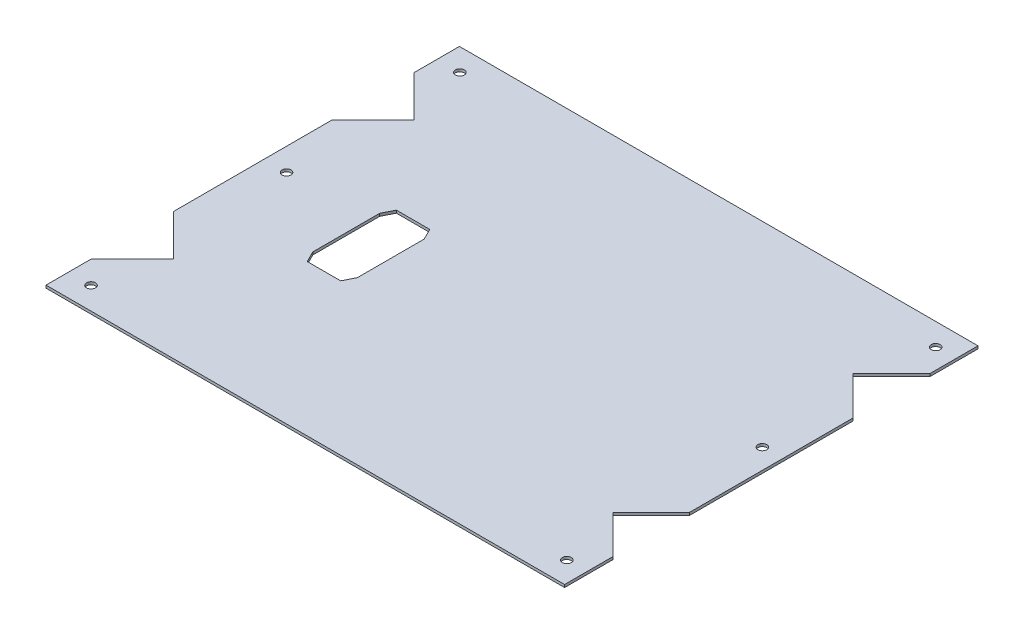
ISO-10303-21;
HEADER;
FILE_DESCRIPTION(('STEP AP214'),'2;1');
FILE_NAME('part.step','',(''),(''),'','','');
FILE_SCHEMA(('AUTOMOTIVE_DESIGN { 1 0 10303 214 1 1 1 1 }'));
ENDSEC;
DATA;
#1=APPLICATION_CONTEXT('core data for automotive mechanical design processes');
#2=APPLICATION_PROTOCOL_DEFINITION('international standard','automotive_design',2000,#1);
#3=PRODUCT_CONTEXT('',#1,'mechanical');
#4=PRODUCT('Part','Part','',(#3));
#5=PRODUCT_RELATED_PRODUCT_CATEGORY('part','',(#4));
#6=PRODUCT_DEFINITION_FORMATION('','',#4);
#7=PRODUCT_DEFINITION_CONTEXT('part definition',#1,'design');
#8=PRODUCT_DEFINITION('design','',#6,#7);
#9=PRODUCT_DEFINITION_SHAPE('','',#8);
#10=(LENGTH_UNIT() NAMED_UNIT(*) SI_UNIT(.MILLI.,.METRE.));
#11=(NAMED_UNIT(*) PLANE_ANGLE_UNIT() SI_UNIT($,.RADIAN.));
#12=(NAMED_UNIT(*) SI_UNIT($,.STERADIAN.) SOLID_ANGLE_UNIT());
#13=UNCERTAINTY_MEASURE_WITH_UNIT(LENGTH_MEASURE(1.E-05),#10,'distance_accuracy_value','');
#14=(GEOMETRIC_REPRESENTATION_CONTEXT(3) GLOBAL_UNCERTAINTY_ASSIGNED_CONTEXT((#13)) GLOBAL_UNIT_ASSIGNED_CONTEXT((#10,
#11,#12)) REPRESENTATION_CONTEXT('',''));
#15=CARTESIAN_POINT('',(0.,0.,0.));
#16=DIRECTION('',(0.,0.,1.));
#17=DIRECTION('',(1.,0.,0.));
#18=AXIS2_PLACEMENT_3D('',#15,#16,#17);
#19=CARTESIAN_POINT('',(0.,1.2,0.));
#20=DIRECTION('',(0.,-1.,0.));
#21=DIRECTION('',(0.,0.,-1.));
#22=AXIS2_PLACEMENT_3D('',#19,#20,#21);
#23=PLANE('',#22);
#24=DIRECTION('',(0.707106781186555,0.,0.70710678118654));
#25=VECTOR('',#24,1.);
#26=CARTESIAN_POINT('',(-8.29720542096546,1.19999999999937,-10.8767766953194));
#27=LINE('',#26,#25);
#28=CARTESIAN_POINT('',(-16.9739821162847,1.19999999999928,-19.5535533906384));
#29=VERTEX_POINT('',#28);
#30=CARTESIAN_POINT('',(1.46656233249632,1.19999999999947,-1.1130089418578));
#31=VERTEX_POINT('',#30);
#32=EDGE_CURVE('E730',#29,#31,#27,.T.);
#33=ORIENTED_EDGE('',*,*,#32,.T.);
#34=DIRECTION('',(-0.707106781186548,0.,0.707106781186547));
#35=VECTOR('',#34,1.);
#36=CARTESIAN_POINT('',(-27.1972054209779,1.19999999999882,27.5507588116164));
#37=LINE('',#36,#35);
#38=CARTESIAN_POINT('',(-16.9739821162848,1.19999999999885,17.3275355069233));
#39=VERTEX_POINT('',#38);
#40=EDGE_CURVE('E618',#31,#39,#37,.T.);
#41=ORIENTED_EDGE('',*,*,#40,.T.);
#42=DIRECTION('',(0.,0.,1.));
#43=VECTOR('',#42,1.);
#44=CARTESIAN_POINT('',(-16.9739821162848,1.19999999999878,37.7739821163095));
#45=LINE('',#44,#43);
#46=CARTESIAN_POINT('',(-16.9739821162848,1.19999999999878,37.7739821163095));
#47=VERTEX_POINT('',#46);
#48=EDGE_CURVE('E632',#47,#39,#45,.F.);
#49=ORIENTED_EDGE('',*,*,#48,.F.);
#50=DIRECTION('',(1.,0.,0.));
#51=VECTOR('',#50,1.);
#52=CARTESIAN_POINT('',(215.773982116274,1.19999999999876,37.7739821163095));
#53=LINE('',#52,#51);
#54=CARTESIAN_POINT('',(215.773982116274,1.19999999999876,37.7739821163092));
#55=VERTEX_POINT('',#54);
#56=EDGE_CURVE('E621',#47,#55,#53,.T.);
#57=ORIENTED_EDGE('',*,*,#56,.T.);
#58=DIRECTION('',(0.,0.,-1.));
#59=VECTOR('',#58,1.);
#60=CARTESIAN_POINT('',(215.773982116274,1.19999999999956,-0.0260178836905514));
#61=LINE('',#60,#59);
#62=CARTESIAN_POINT('',(215.773982116274,1.19999999999923,16.1275355069061));
#63=VERTEX_POINT('',#62);
#64=EDGE_CURVE('E641',#63,#55,#61,.F.);
#65=ORIENTED_EDGE('',*,*,#64,.F.);
#66=DIRECTION('',(-0.70710678118656,0.,-0.707106781186535));
#67=VECTOR('',#66,1.);
#68=CARTESIAN_POINT('',(207.697205420976,1.19999999999942,8.05075881160807));
#69=LINE('',#68,#67);
#70=CARTESIAN_POINT('',(198.533437667526,1.19999999999961,-1.11300894184206));
#71=VERTEX_POINT('',#70);
#72=EDGE_CURVE('E624',#63,#71,#69,.T.);
#73=ORIENTED_EDGE('',*,*,#72,.T.);
#74=DIRECTION('',(0.707106781186543,0.,-0.707106781186552));
#75=VECTOR('',#74,1.);
#76=CARTESIAN_POINT('',(260.497205420979,1.1999999999997,-63.0767766952964));
#77=LINE('',#76,#75);
#78=CARTESIAN_POINT('',(215.773982116275,1.19999999999945,-18.3535533905913));
#79=VERTEX_POINT('',#78);
#80=EDGE_CURVE('E704',#71,#79,#77,.T.);
#81=ORIENTED_EDGE('',*,*,#80,.T.);
#82=DIRECTION('',(0.,0.,-1.));
#83=VECTOR('',#82,1.);
#84=CARTESIAN_POINT('',(215.773982116275,1.20000000000006,-107.8));
#85=LINE('',#84,#83);
#86=CARTESIAN_POINT('',(215.773982116275,1.19999999999995,-91.6464466094031));
#87=VERTEX_POINT('',#86);
#88=EDGE_CURVE('E713',#87,#79,#85,.F.);
#89=ORIENTED_EDGE('',*,*,#88,.F.);
#90=DIRECTION('',(-0.707106781186554,0.,-0.707106781186541));
#91=VECTOR('',#90,1.);
#92=CARTESIAN_POINT('',(207.697205420976,1.20000000000003,-99.7232233047014));
#93=LINE('',#92,#91);
#94=CARTESIAN_POINT('',(198.533437667532,1.20000000000009,-108.886991058146));
#95=VERTEX_POINT('',#94);
#96=EDGE_CURVE('E702',#87,#95,#93,.T.);
#97=ORIENTED_EDGE('',*,*,#96,.T.);
#98=DIRECTION('',(0.707106781186549,0.,-0.707106781186546));
#99=VECTOR('',#98,1.);
#100=CARTESIAN_POINT('',(226.597205420989,1.19999999999951,-136.950758811603));
#101=LINE('',#100,#99);
#102=CARTESIAN_POINT('',(215.773982116275,1.19999999999962,-126.127535506889));
#103=VERTEX_POINT('',#102);
#104=EDGE_CURVE('E597',#95,#103,#101,.T.);
#105=ORIENTED_EDGE('',*,*,#104,.T.);
#106=DIRECTION('',(0.,0.,-1.));
#107=VECTOR('',#106,1.);
#108=CARTESIAN_POINT('',(215.773982116275,1.19999999999947,-147.773982116317));
#109=LINE('',#108,#107);
#110=CARTESIAN_POINT('',(215.773982116275,1.19999999999947,-147.773982116317));
#111=VERTEX_POINT('',#110);
#112=EDGE_CURVE('E667',#111,#103,#109,.F.);
#113=ORIENTED_EDGE('',*,*,#112,.F.);
#114=DIRECTION('',(1.,0.,0.));
#115=VECTOR('',#114,1.);
#116=CARTESIAN_POINT('',(215.773982116275,1.19999999999947,-147.773982116317));
#117=LINE('',#116,#115);
#118=CARTESIAN_POINT('',(-16.9739821162845,1.19999999999817,-147.773982116316));
#119=VERTEX_POINT('',#118);
#120=EDGE_CURVE('E663',#111,#119,#117,.F.);
#121=ORIENTED_EDGE('',*,*,#120,.T.);
#122=DIRECTION('',(0.,0.,1.));
#123=VECTOR('',#122,1.);
#124=CARTESIAN_POINT('',(-16.9739821162845,1.19999999999909,-109.973982116317));
#125=LINE('',#124,#123);
#126=CARTESIAN_POINT('',(-16.9739821162845,1.19999999999867,-127.327535506915));
#127=VERTEX_POINT('',#126);
#128=EDGE_CURVE('E678',#127,#119,#125,.F.);
#129=ORIENTED_EDGE('',*,*,#128,.F.);
#130=DIRECTION('',(0.707106781186561,0.,0.707106781186534));
#131=VECTOR('',#130,1.);
#132=CARTESIAN_POINT('',(-8.29720542098548,1.19999999999888,-118.650758811616));
#133=LINE('',#132,#131);
#134=CARTESIAN_POINT('',(1.46656233246933,1.19999999999911,-108.886991058161));
#135=VERTEX_POINT('',#134);
#136=EDGE_CURVE('E661',#127,#135,#133,.T.);
#137=ORIENTED_EDGE('',*,*,#136,.T.);
#138=DIRECTION('',(-0.707106781186541,0.,0.707106781186554));
#139=VECTOR('',#138,1.);
#140=CARTESIAN_POINT('',(-61.0972054209882,1.19999999999901,-46.3232233047028));
#141=LINE('',#140,#139);
#142=CARTESIAN_POINT('',(-16.9739821162847,1.19999999999854,-90.4464466094071));
#143=VERTEX_POINT('',#142);
#144=EDGE_CURVE('E732',#135,#143,#141,.T.);
#145=ORIENTED_EDGE('',*,*,#144,.T.);
#146=DIRECTION('',(0.,0.,1.));
#147=VECTOR('',#146,1.);
#148=CARTESIAN_POINT('',(-16.9739821162847,1.19999999999947,-2.2));
#149=LINE('',#148,#147);
#150=EDGE_CURVE('E738',#29,#143,#149,.F.);
#151=ORIENTED_EDGE('',*,*,#150,.F.);
#152=EDGE_LOOP('',(#33,#41,#49,#57,#65,#73,#81,#89,#97,#105,#113,#121,#129,#137,#145,#151));
#153=FACE_BOUND('',#152,.T.);
#154=DIRECTION('',(-0.447213595499958,0.,0.894427190999916));
#155=VECTOR('',#154,1.);
#156=CARTESIAN_POINT('',(30.,1.2,-65.));
#157=LINE('',#156,#155);
#158=CARTESIAN_POINT('',(32.5,1.2,-70.));
#159=VERTEX_POINT('',#158);
#160=CARTESIAN_POINT('',(30.,1.2,-65.));
#161=VERTEX_POINT('',#160);
#162=EDGE_CURVE('E742',#159,#161,#157,.T.);
#163=ORIENTED_EDGE('',*,*,#162,.F.);
#164=DIRECTION('',(-1.,0.,0.));
#165=VECTOR('',#164,1.);
#166=CARTESIAN_POINT('',(32.5,1.2,-70.));
#167=LINE('',#166,#165);
#168=CARTESIAN_POINT('',(47.5,1.2,-70.));
#169=VERTEX_POINT('',#168);
#170=EDGE_CURVE('E757',#169,#159,#167,.T.);
#171=ORIENTED_EDGE('',*,*,#170,.F.);
#172=DIRECTION('',(-0.447213595499958,0.,-0.894427190999916));
#173=VECTOR('',#172,1.);
#174=CARTESIAN_POINT('',(47.5,1.2,-70.));
#175=LINE('',#174,#173);
#176=CARTESIAN_POINT('',(50.,1.2,-65.));
#177=VERTEX_POINT('',#176);
#178=EDGE_CURVE('E755',#177,#169,#175,.T.);
#179=ORIENTED_EDGE('',*,*,#178,.F.);
#180=DIRECTION('',(0.,0.,-1.));
#181=VECTOR('',#180,1.);
#182=CARTESIAN_POINT('',(50.,1.2,-65.));
#183=LINE('',#182,#181);
#184=CARTESIAN_POINT('',(50.,1.2,-35.));
#185=VERTEX_POINT('',#184);
#186=EDGE_CURVE('E753',#185,#177,#183,.T.);
#187=ORIENTED_EDGE('',*,*,#186,.F.);
#188=DIRECTION('',(0.447213595499959,0.,-0.894427190999915));
#189=VECTOR('',#188,1.);
#190=CARTESIAN_POINT('',(50.,1.2,-35.));
#191=LINE('',#190,#189);
#192=CARTESIAN_POINT('',(47.5,1.2,-30.));
#193=VERTEX_POINT('',#192);
#194=EDGE_CURVE('E751',#193,#185,#191,.T.);
#195=ORIENTED_EDGE('',*,*,#194,.F.);
#196=DIRECTION('',(1.,0.,0.));
#197=VECTOR('',#196,1.);
#198=CARTESIAN_POINT('',(47.5,1.2,-30.));
#199=LINE('',#198,#197);
#200=CARTESIAN_POINT('',(32.5,1.2,-30.));
#201=VERTEX_POINT('',#200);
#202=EDGE_CURVE('E749',#201,#193,#199,.T.);
#203=ORIENTED_EDGE('',*,*,#202,.F.);
#204=DIRECTION('',(0.447213595499958,0.,0.894427190999916));
#205=VECTOR('',#204,1.);
#206=CARTESIAN_POINT('',(32.5,1.2,-30.));
#207=LINE('',#206,#205);
#208=CARTESIAN_POINT('',(30.,1.2,-35.));
#209=VERTEX_POINT('',#208);
#210=EDGE_CURVE('E747',#209,#201,#207,.T.);
#211=ORIENTED_EDGE('',*,*,#210,.F.);
#212=DIRECTION('',(0.,0.,1.));
#213=VECTOR('',#212,1.);
#214=CARTESIAN_POINT('',(30.,1.2,-65.));
#215=LINE('',#214,#213);
#216=EDGE_CURVE('E744',#161,#209,#215,.T.);
#217=ORIENTED_EDGE('',*,*,#216,.F.);
#218=EDGE_LOOP('',(#163,#171,#179,#187,#195,#203,#211,#217));
#219=FACE_BOUND('',#218,.T.);
#220=CARTESIAN_POINT('',(-6.77398211619506,1.19999999999886,-59.9999999999999));
#221=DIRECTION('',(0.,1.,0.));
#222=DIRECTION('',(-1.,0.,0.));
#223=AXIS2_PLACEMENT_3D('',#220,#221,#222);
#224=CIRCLE('',#223,2.);
#225=CARTESIAN_POINT('',(-8.77398211619506,1.19999999999886,-59.9999999999999));
#226=VERTEX_POINT('',#225);
#227=EDGE_CURVE('E735',#226,#226,#224,.T.);
#228=ORIENTED_EDGE('',*,*,#227,.F.);
#229=EDGE_LOOP('',(#228));
#230=FACE_BOUND('',#229,.T.);
#231=CARTESIAN_POINT('',(206.773982116275,1.19999999999978,-60.0000000000001));
#232=DIRECTION('',(0.,1.,0.));
#233=DIRECTION('',(-1.,0.,0.));
#234=AXIS2_PLACEMENT_3D('',#231,#232,#233);
#235=CIRCLE('',#234,2.);
#236=CARTESIAN_POINT('',(204.773982116275,1.19999999999979,-60.));
#237=VERTEX_POINT('',#236);
#238=EDGE_CURVE('E710',#237,#237,#235,.T.);
#239=ORIENTED_EDGE('',*,*,#238,.F.);
#240=EDGE_LOOP('',(#239));
#241=FACE_BOUND('',#240,.T.);
#242=CARTESIAN_POINT('',(-6.77398211628509,1.19999999999841,-137.773982116225));
#243=DIRECTION('',(0.,1.,0.));
#244=DIRECTION('',(1.,0.,0.));
#245=AXIS2_PLACEMENT_3D('',#242,#243,#244);
#246=CIRCLE('',#245,2.);
#247=CARTESIAN_POINT('',(-4.77398211628509,1.19999999999841,-137.773982116225));
#248=VERTEX_POINT('',#247);
#249=EDGE_CURVE('E688',#248,#248,#246,.T.);
#250=ORIENTED_EDGE('',*,*,#249,.F.);
#251=EDGE_LOOP('',(#250));
#252=FACE_BOUND('',#251,.T.);
#253=CARTESIAN_POINT('',(206.773982116274,1.19999999999952,-137.773982116316));
#254=DIRECTION('',(0.,1.,0.));
#255=DIRECTION('',(1.,0.,0.));
#256=AXIS2_PLACEMENT_3D('',#253,#254,#255);
#257=CIRCLE('',#256,2.);
#258=CARTESIAN_POINT('',(208.773982116274,1.19999999999952,-137.773982116316));
#259=VERTEX_POINT('',#258);
#260=EDGE_CURVE('E612',#259,#259,#257,.T.);
#261=ORIENTED_EDGE('',*,*,#260,.F.);
#262=EDGE_LOOP('',(#261));
#263=FACE_BOUND('',#262,.T.);
#264=CARTESIAN_POINT('',(-6.77398211628492,1.19999999999881,27.7739821162591));
#265=DIRECTION('',(0.,1.,0.));
#266=DIRECTION('',(-1.,0.,0.));
#267=AXIS2_PLACEMENT_3D('',#264,#265,#266);
#268=CIRCLE('',#267,2.);
#269=CARTESIAN_POINT('',(-8.77398211628492,1.19999999999881,27.7739821162591));
#270=VERTEX_POINT('',#269);
#271=EDGE_CURVE('E646',#270,#270,#268,.T.);
#272=ORIENTED_EDGE('',*,*,#271,.F.);
#273=EDGE_LOOP('',(#272));
#274=FACE_BOUND('',#273,.T.);
#275=CARTESIAN_POINT('',(206.773982116274,1.19999999999899,27.7739821163497));
#276=DIRECTION('',(0.,1.,0.));
#277=DIRECTION('',(-1.,0.,0.));
#278=AXIS2_PLACEMENT_3D('',#275,#276,#277);
#279=CIRCLE('',#278,2.);
#280=CARTESIAN_POINT('',(204.773982116274,1.19999999999899,27.7739821163497));
#281=VERTEX_POINT('',#280);
#282=EDGE_CURVE('E609',#281,#281,#279,.T.);
#283=ORIENTED_EDGE('',*,*,#282,.F.);
#284=EDGE_LOOP('',(#283));
#285=FACE_BOUND('',#284,.T.);
#286=ADVANCED_FACE('F407',(#153,#219,#230,#241,#252,#263,#274,#285),#23,.F.);
#287=CARTESIAN_POINT('',(0.,0.,0.));
#288=DIRECTION('',(0.,-1.,0.));
#289=DIRECTION('',(0.,0.,-1.));
#290=AXIS2_PLACEMENT_3D('',#287,#288,#289);
#291=PLANE('',#290);
#292=DIRECTION('',(-0.707106781186548,0.,0.707106781186547));
#293=VECTOR('',#292,1.);
#294=CARTESIAN_POINT('',(-27.1972054209779,-1.18326433589518E-12,27.5507588116164));
#295=LINE('',#294,#293);
#296=CARTESIAN_POINT('',(1.46656233249632,-5.26488574958961E-13,-1.11300894185779));
#297=VERTEX_POINT('',#296);
#298=CARTESIAN_POINT('',(-16.9739821162848,-1.14996634274895E-12,17.3275355069233));
#299=VERTEX_POINT('',#298);
#300=EDGE_CURVE('E613',#297,#299,#295,.T.);
#301=ORIENTED_EDGE('',*,*,#300,.F.);
#302=DIRECTION('',(0.707106781186555,0.,0.70710678118654));
#303=VECTOR('',#302,1.);
#304=CARTESIAN_POINT('',(-8.29720542096546,-6.27261134604597E-13,-10.8767766953194));
#305=LINE('',#304,#303);
#306=CARTESIAN_POINT('',(-16.9739821162847,-7.17145081250211E-13,-19.5535533906384));
#307=VERTEX_POINT('',#306);
#308=EDGE_CURVE('E717',#307,#297,#305,.T.);
#309=ORIENTED_EDGE('',*,*,#308,.F.);
#310=DIRECTION('',(0.,0.,1.));
#311=VECTOR('',#310,1.);
#312=CARTESIAN_POINT('',(-16.9739821162847,-5.34579865802318E-13,-2.19999999999999));
#313=LINE('',#312,#311);
#314=CARTESIAN_POINT('',(-16.9739821162847,-1.46296215011584E-12,-90.4464466094071));
#315=VERTEX_POINT('',#314);
#316=EDGE_CURVE('E719',#307,#315,#313,.F.);
#317=ORIENTED_EDGE('',*,*,#316,.T.);
#318=DIRECTION('',(-0.707106781186541,0.,0.707106781186554));
#319=VECTOR('',#318,1.);
#320=CARTESIAN_POINT('',(-61.0972054209882,-9.91081909756227E-13,-46.3232233047028));
#321=LINE('',#320,#319);
#322=CARTESIAN_POINT('',(1.46656233246933,-8.85793174920657E-13,-108.886991058161));
#323=VERTEX_POINT('',#322);
#324=EDGE_CURVE('E727',#323,#315,#321,.T.);
#325=ORIENTED_EDGE('',*,*,#324,.F.);
#326=DIRECTION('',(0.707106781186561,0.,0.707106781186534));
#327=VECTOR('',#326,1.);
#328=CARTESIAN_POINT('',(-8.29720542098548,-1.12410081243297E-12,-118.650758811616));
#329=LINE('',#328,#327);
#330=CARTESIAN_POINT('',(-16.9739821162845,-1.33226762955019E-12,-127.327535506915));
#331=VERTEX_POINT('',#330);
#332=EDGE_CURVE('E592',#331,#323,#329,.T.);
#333=ORIENTED_EDGE('',*,*,#332,.F.);
#334=DIRECTION('',(0.,0.,1.));
#335=VECTOR('',#334,1.);
#336=CARTESIAN_POINT('',(-16.9739821162845,-9.15933995315754E-13,-109.973982116317));
#337=LINE('',#336,#335);
#338=CARTESIAN_POINT('',(-16.9739821162845,-1.83186799063151E-12,-147.773982116316));
#339=VERTEX_POINT('',#338);
#340=EDGE_CURVE('E672',#331,#339,#337,.F.);
#341=ORIENTED_EDGE('',*,*,#340,.T.);
#342=DIRECTION('',(1.,0.,0.));
#343=VECTOR('',#342,1.);
#344=CARTESIAN_POINT('',(215.773982116275,-5.41233724504764E-13,-147.773982116317));
#345=LINE('',#344,#343);
#346=CARTESIAN_POINT('',(215.773982116275,-5.41233724504764E-13,-147.773982116317));
#347=VERTEX_POINT('',#346);
#348=EDGE_CURVE('E686',#347,#339,#345,.F.);
#349=ORIENTED_EDGE('',*,*,#348,.F.);
#350=DIRECTION('',(0.,0.,-1.));
#351=VECTOR('',#350,1.);
#352=CARTESIAN_POINT('',(215.773982116275,-5.41233724504764E-13,-147.773982116317));
#353=LINE('',#352,#351);
#354=CARTESIAN_POINT('',(215.773982116275,-3.88578058618805E-13,-126.127535506889));
#355=VERTEX_POINT('',#354);
#356=EDGE_CURVE('E589',#347,#355,#353,.F.);
#357=ORIENTED_EDGE('',*,*,#356,.T.);
#358=DIRECTION('',(0.707106781186549,0.,-0.707106781186546));
#359=VECTOR('',#358,1.);
#360=CARTESIAN_POINT('',(226.597205420989,-4.9960036108132E-13,-136.950758811603));
#361=LINE('',#360,#359);
#362=CARTESIAN_POINT('',(198.533437667532,0.,-108.886991058146));
#363=VERTEX_POINT('',#362);
#364=EDGE_CURVE('E584',#363,#355,#361,.T.);
#365=ORIENTED_EDGE('',*,*,#364,.F.);
#366=DIRECTION('',(-0.707106781186554,0.,-0.707106781186541));
#367=VECTOR('',#366,1.);
#368=CARTESIAN_POINT('',(207.697205420976,0.,-99.7232233047014));
#369=LINE('',#368,#367);
#370=CARTESIAN_POINT('',(215.773982116275,0.,-91.6464466094032));
#371=VERTEX_POINT('',#370);
#372=EDGE_CURVE('E569',#371,#363,#369,.T.);
#373=ORIENTED_EDGE('',*,*,#372,.F.);
#374=DIRECTION('',(0.,0.,-1.));
#375=VECTOR('',#374,1.);
#376=CARTESIAN_POINT('',(215.773982116275,0.,-107.8));
#377=LINE('',#376,#375);
#378=CARTESIAN_POINT('',(215.773982116275,-5.55111512312578E-13,-18.3535533905913));
#379=VERTEX_POINT('',#378);
#380=EDGE_CURVE('E580',#371,#379,#377,.F.);
#381=ORIENTED_EDGE('',*,*,#380,.T.);
#382=DIRECTION('',(0.707106781186543,0.,-0.707106781186552));
#383=VECTOR('',#382,1.);
#384=CARTESIAN_POINT('',(260.497205420979,-3.05311331771918E-13,-63.0767766952964));
#385=LINE('',#384,#383);
#386=CARTESIAN_POINT('',(198.533437667526,-3.94215909915729E-13,-1.11300894184208));
#387=VERTEX_POINT('',#386);
#388=EDGE_CURVE('E699',#387,#379,#385,.T.);
#389=ORIENTED_EDGE('',*,*,#388,.F.);
#390=DIRECTION('',(-0.70710678118656,0.,-0.707106781186535));
#391=VECTOR('',#390,1.);
#392=CARTESIAN_POINT('',(207.697205420976,-5.85571675505244E-13,8.05075881160805));
#393=LINE('',#392,#391);
#394=CARTESIAN_POINT('',(215.773982116274,-7.80305044308654E-13,16.1275355069061));
#395=VERTEX_POINT('',#394);
#396=EDGE_CURVE('E616',#395,#387,#393,.T.);
#397=ORIENTED_EDGE('',*,*,#396,.F.);
#398=DIRECTION('',(0.,0.,-1.));
#399=VECTOR('',#398,1.);
#400=CARTESIAN_POINT('',(215.773982116274,-4.4634945793309E-13,-0.0260178836905766));
#401=LINE('',#400,#399);
#402=CARTESIAN_POINT('',(215.773982116274,-1.24446126731645E-12,37.7739821163091));
#403=VERTEX_POINT('',#402);
#404=EDGE_CURVE('E638',#395,#403,#401,.F.);
#405=ORIENTED_EDGE('',*,*,#404,.T.);
#406=DIRECTION('',(1.,0.,0.));
#407=VECTOR('',#406,1.);
#408=CARTESIAN_POINT('',(215.773982116274,-1.24446126731645E-12,37.7739821163095));
#409=LINE('',#408,#407);
#410=CARTESIAN_POINT('',(-16.9739821162848,-1.22041639802509E-12,37.7739821163095));
#411=VERTEX_POINT('',#410);
#412=EDGE_CURVE('E651',#411,#403,#409,.T.);
#413=ORIENTED_EDGE('',*,*,#412,.F.);
#414=DIRECTION('',(0.,0.,1.));
#415=VECTOR('',#414,1.);
#416=CARTESIAN_POINT('',(-16.9739821162848,-1.22041639802509E-12,37.7739821163095));
#417=LINE('',#416,#415);
#418=EDGE_CURVE('E626',#411,#299,#417,.F.);
#419=ORIENTED_EDGE('',*,*,#418,.T.);
#420=EDGE_LOOP('',(#301,#309,#317,#325,#333,#341,#349,#357,#365,#373,#381,#389,#397,#405,#413,#419));
#421=FACE_BOUND('',#420,.T.);
#422=DIRECTION('',(-1.,0.,0.));
#423=VECTOR('',#422,1.);
#424=CARTESIAN_POINT('',(32.5,0.,-70.));
#425=LINE('',#424,#423);
#426=CARTESIAN_POINT('',(47.5,0.,-70.));
#427=VERTEX_POINT('',#426);
#428=CARTESIAN_POINT('',(32.5,0.,-70.));
#429=VERTEX_POINT('',#428);
#430=EDGE_CURVE('E745',#427,#429,#425,.T.);
#431=ORIENTED_EDGE('',*,*,#430,.T.);
#432=DIRECTION('',(-0.447213595499958,0.,0.894427190999916));
#433=VECTOR('',#432,1.);
#434=CARTESIAN_POINT('',(30.,0.,-65.));
#435=LINE('',#434,#433);
#436=CARTESIAN_POINT('',(30.,0.,-65.));
#437=VERTEX_POINT('',#436);
#438=EDGE_CURVE('E429',#429,#437,#435,.T.);
#439=ORIENTED_EDGE('',*,*,#438,.T.);
#440=DIRECTION('',(0.,0.,1.));
#441=VECTOR('',#440,1.);
#442=CARTESIAN_POINT('',(30.,0.,-65.));
#443=LINE('',#442,#441);
#444=CARTESIAN_POINT('',(30.,0.,-35.));
#445=VERTEX_POINT('',#444);
#446=EDGE_CURVE('E761',#437,#445,#443,.T.);
#447=ORIENTED_EDGE('',*,*,#446,.T.);
#448=DIRECTION('',(0.447213595499958,0.,0.894427190999916));
#449=VECTOR('',#448,1.);
#450=CARTESIAN_POINT('',(32.5,0.,-30.));
#451=LINE('',#450,#449);
#452=CARTESIAN_POINT('',(32.5,0.,-30.));
#453=VERTEX_POINT('',#452);
#454=EDGE_CURVE('E764',#445,#453,#451,.T.);
#455=ORIENTED_EDGE('',*,*,#454,.T.);
#456=DIRECTION('',(1.,0.,0.));
#457=VECTOR('',#456,1.);
#458=CARTESIAN_POINT('',(47.5,0.,-30.));
#459=LINE('',#458,#457);
#460=CARTESIAN_POINT('',(47.5,0.,-30.));
#461=VERTEX_POINT('',#460);
#462=EDGE_CURVE('E767',#453,#461,#459,.T.);
#463=ORIENTED_EDGE('',*,*,#462,.T.);
#464=DIRECTION('',(0.447213595499959,0.,-0.894427190999915));
#465=VECTOR('',#464,1.);
#466=CARTESIAN_POINT('',(50.,0.,-35.));
#467=LINE('',#466,#465);
#468=CARTESIAN_POINT('',(50.,0.,-35.));
#469=VERTEX_POINT('',#468);
#470=EDGE_CURVE('E770',#461,#469,#467,.T.);
#471=ORIENTED_EDGE('',*,*,#470,.T.);
#472=DIRECTION('',(0.,0.,-1.));
#473=VECTOR('',#472,1.);
#474=CARTESIAN_POINT('',(50.,0.,-65.));
#475=LINE('',#474,#473);
#476=CARTESIAN_POINT('',(50.,0.,-65.));
#477=VERTEX_POINT('',#476);
#478=EDGE_CURVE('E773',#469,#477,#475,.T.);
#479=ORIENTED_EDGE('',*,*,#478,.T.);
#480=DIRECTION('',(-0.447213595499958,0.,-0.894427190999916));
#481=VECTOR('',#480,1.);
#482=CARTESIAN_POINT('',(47.5,0.,-70.));
#483=LINE('',#482,#481);
#484=EDGE_CURVE('E776',#477,#427,#483,.T.);
#485=ORIENTED_EDGE('',*,*,#484,.T.);
#486=EDGE_LOOP('',(#431,#439,#447,#455,#463,#471,#479,#485));
#487=FACE_BOUND('',#486,.T.);
#488=CARTESIAN_POINT('',(-6.77398211619451,-5.28102903748392E-12,-59.9999999999999));
#489=DIRECTION('',(-4.58830951171779E-13,1.,0.));
#490=DIRECTION('',(-1.,-4.58830951171779E-13,0.));
#491=AXIS2_PLACEMENT_3D('',#488,#489,#490);
#492=CIRCLE('',#491,2.);
#493=CARTESIAN_POINT('',(-8.77398211619452,-6.19869093982748E-12,-59.9999999999999));
#494=VERTEX_POINT('',#493);
#495=EDGE_CURVE('E722',#494,#494,#492,.T.);
#496=ORIENTED_EDGE('',*,*,#495,.T.);
#497=EDGE_LOOP('',(#496));
#498=FACE_BOUND('',#497,.T.);
#499=CARTESIAN_POINT('',(206.773982116276,9.6034291630076E-12,-60.0000000000001));
#500=DIRECTION('',(1.08978213844371E-12,-1.,0.));
#501=DIRECTION('',(1.,1.08978213844371E-12,0.));
#502=AXIS2_PLACEMENT_3D('',#499,#500,#501);
#503=CIRCLE('',#502,2.);
#504=CARTESIAN_POINT('',(208.773982116276,1.1782993439895E-11,-60.0000000000001));
#505=VERTEX_POINT('',#504);
#506=EDGE_CURVE('E707',#505,#505,#503,.T.);
#507=ORIENTED_EDGE('',*,*,#506,.F.);
#508=EDGE_LOOP('',(#507));
#509=FACE_BOUND('',#508,.T.);
#510=CARTESIAN_POINT('',(206.773982116275,1.89709359332824E-11,-137.773982116317));
#511=DIRECTION('',(6.30889954931976E-13,-1.,-4.51729329736964E-13));
#512=DIRECTION('',(0.,4.51729329736966E-13,-1.));
#513=AXIS2_PLACEMENT_3D('',#510,#511,#512);
#514=CIRCLE('',#513,2.);
#515=CARTESIAN_POINT('',(206.773982116275,1.98743945927563E-11,-139.773982116317));
#516=VERTEX_POINT('',#515);
#517=EDGE_CURVE('E691',#516,#516,#514,.T.);
#518=ORIENTED_EDGE('',*,*,#517,.F.);
#519=EDGE_LOOP('',(#518));
#520=FACE_BOUND('',#519,.T.);
#521=CARTESIAN_POINT('',(-6.77398211628509,-1.53627111032506E-11,-137.773982116225));
#522=DIRECTION('',(0.,1.,-4.83378445039087E-13));
#523=DIRECTION('',(0.,-4.83378445039087E-13,-1.));
#524=AXIS2_PLACEMENT_3D('',#521,#522,#523);
#525=CIRCLE('',#524,2.);
#526=CARTESIAN_POINT('',(-6.77398211628513,-1.63294679933288E-11,-139.773982116225));
#527=VERTEX_POINT('',#526);
#528=EDGE_CURVE('E675',#527,#527,#525,.T.);
#529=ORIENTED_EDGE('',*,*,#528,.T.);
#530=EDGE_LOOP('',(#529));
#531=FACE_BOUND('',#530,.T.);
#532=CARTESIAN_POINT('',(-6.77398211628492,-1.49555189857554E-11,27.7739821162586));
#533=DIRECTION('',(0.,1.,4.6233777269513E-13));
#534=DIRECTION('',(0.,-4.6233777269513E-13,1.));
#535=AXIS2_PLACEMENT_3D('',#532,#533,#534);
#536=CIRCLE('',#535,2.);
#537=CARTESIAN_POINT('',(-6.77398211628492,-1.58801945311457E-11,29.7739821162586));
#538=VERTEX_POINT('',#537);
#539=EDGE_CURVE('E629',#538,#538,#536,.T.);
#540=ORIENTED_EDGE('',*,*,#539,.T.);
#541=EDGE_LOOP('',(#540));
#542=FACE_BOUND('',#541,.T.);
#543=CARTESIAN_POINT('',(206.773982116275,1.84414010819371E-11,27.7739821163502));
#544=DIRECTION('',(6.30889954931976E-13,-1.,4.38123186575764E-13));
#545=DIRECTION('',(0.,4.38123186575775E-13,1.));
#546=AXIS2_PLACEMENT_3D('',#543,#544,#545);
#547=CIRCLE('',#546,2.);
#548=CARTESIAN_POINT('',(206.773982116275,1.93176474550887E-11,29.7739821163502));
#549=VERTEX_POINT('',#548);
#550=EDGE_CURVE('E654',#549,#549,#547,.T.);
#551=ORIENTED_EDGE('',*,*,#550,.F.);
#552=EDGE_LOOP('',(#551));
#553=FACE_BOUND('',#552,.T.);
#554=ADVANCED_FACE('F409',(#421,#487,#498,#509,#520,#531,#542,#553),#291,.T.);
#555=CARTESIAN_POINT('',(30.,1.2,-65.));
#556=DIRECTION('',(0.894427190999916,0.,0.447213595499958));
#557=DIRECTION('',(0.447213595499958,0.,-0.894427190999916));
#558=AXIS2_PLACEMENT_3D('',#555,#556,#557);
#559=PLANE('',#558);
#560=ORIENTED_EDGE('',*,*,#438,.F.);
#561=DIRECTION('',(0.,-1.,0.));
#562=VECTOR('',#561,1.);
#563=CARTESIAN_POINT('',(32.5,1.2,-70.));
#564=LINE('',#563,#562);
#565=EDGE_CURVE('E759',#159,#429,#564,.T.);
#566=ORIENTED_EDGE('',*,*,#565,.F.);
#567=ORIENTED_EDGE('',*,*,#162,.T.);
#568=DIRECTION('',(0.,-1.,0.));
#569=VECTOR('',#568,1.);
#570=CARTESIAN_POINT('',(30.,1.2,-65.));
#571=LINE('',#570,#569);
#572=EDGE_CURVE('E13',#161,#437,#571,.T.);
#573=ORIENTED_EDGE('',*,*,#572,.T.);
#574=EDGE_LOOP('',(#560,#566,#567,#573));
#575=FACE_BOUND('',#574,.T.);
#576=ADVANCED_FACE('F806',(#575),#559,.T.);
#577=CARTESIAN_POINT('',(30.,1.2,-65.));
#578=DIRECTION('',(1.,0.,0.));
#579=DIRECTION('',(0.,0.,-1.));
#580=AXIS2_PLACEMENT_3D('',#577,#578,#579);
#581=PLANE('',#580);
#582=ORIENTED_EDGE('',*,*,#446,.F.);
#583=ORIENTED_EDGE('',*,*,#572,.F.);
#584=ORIENTED_EDGE('',*,*,#216,.T.);
#585=DIRECTION('',(0.,-1.,0.));
#586=VECTOR('',#585,1.);
#587=CARTESIAN_POINT('',(30.,1.2,-35.));
#588=LINE('',#587,#586);
#589=EDGE_CURVE('E415',#209,#445,#588,.T.);
#590=ORIENTED_EDGE('',*,*,#589,.T.);
#591=EDGE_LOOP('',(#582,#583,#584,#590));
#592=FACE_BOUND('',#591,.T.);
#593=ADVANCED_FACE('F793',(#592),#581,.T.);
#594=CARTESIAN_POINT('',(32.5,1.2,-30.));
#595=DIRECTION('',(0.894427190999916,0.,-0.447213595499958));
#596=DIRECTION('',(-0.447213595499958,0.,-0.894427190999916));
#597=AXIS2_PLACEMENT_3D('',#594,#595,#596);
#598=PLANE('',#597);
#599=ORIENTED_EDGE('',*,*,#454,.F.);
#600=ORIENTED_EDGE('',*,*,#589,.F.);
#601=ORIENTED_EDGE('',*,*,#210,.T.);
#602=DIRECTION('',(0.,-1.,0.));
#603=VECTOR('',#602,1.);
#604=CARTESIAN_POINT('',(32.5,1.2,-30.));
#605=LINE('',#604,#603);
#606=EDGE_CURVE('E789',#201,#453,#605,.T.);
#607=ORIENTED_EDGE('',*,*,#606,.T.);
#608=EDGE_LOOP('',(#599,#600,#601,#607));
#609=FACE_BOUND('',#608,.T.);
#610=ADVANCED_FACE('F798',(#609),#598,.T.);
#611=CARTESIAN_POINT('',(47.5,1.2,-30.));
#612=DIRECTION('',(0.,0.,-1.));
#613=DIRECTION('',(-1.,0.,0.));
#614=AXIS2_PLACEMENT_3D('',#611,#612,#613);
#615=PLANE('',#614);
#616=ORIENTED_EDGE('',*,*,#462,.F.);
#617=ORIENTED_EDGE('',*,*,#606,.F.);
#618=ORIENTED_EDGE('',*,*,#202,.T.);
#619=DIRECTION('',(0.,-1.,0.));
#620=VECTOR('',#619,1.);
#621=CARTESIAN_POINT('',(47.5,1.2,-30.));
#622=LINE('',#621,#620);
#623=EDGE_CURVE('E787',#193,#461,#622,.T.);
#624=ORIENTED_EDGE('',*,*,#623,.T.);
#625=EDGE_LOOP('',(#616,#617,#618,#624));
#626=FACE_BOUND('',#625,.T.);
#627=ADVANCED_FACE('F813',(#626),#615,.T.);
#628=CARTESIAN_POINT('',(50.,1.2,-35.));
#629=DIRECTION('',(-0.894427190999915,0.,-0.447213595499959));
#630=DIRECTION('',(-0.447213595499959,0.,0.894427190999915));
#631=AXIS2_PLACEMENT_3D('',#628,#629,#630);
#632=PLANE('',#631);
#633=ORIENTED_EDGE('',*,*,#470,.F.);
#634=ORIENTED_EDGE('',*,*,#623,.F.);
#635=ORIENTED_EDGE('',*,*,#194,.T.);
#636=DIRECTION('',(0.,-1.,0.));
#637=VECTOR('',#636,1.);
#638=CARTESIAN_POINT('',(50.,1.2,-35.));
#639=LINE('',#638,#637);
#640=EDGE_CURVE('E785',#185,#469,#639,.T.);
#641=ORIENTED_EDGE('',*,*,#640,.T.);
#642=EDGE_LOOP('',(#633,#634,#635,#641));
#643=FACE_BOUND('',#642,.T.);
#644=ADVANCED_FACE('F818',(#643),#632,.T.);
#645=CARTESIAN_POINT('',(50.,1.2,-65.));
#646=DIRECTION('',(-1.,0.,0.));
#647=DIRECTION('',(0.,0.,1.));
#648=AXIS2_PLACEMENT_3D('',#645,#646,#647);
#649=PLANE('',#648);
#650=ORIENTED_EDGE('',*,*,#478,.F.);
#651=ORIENTED_EDGE('',*,*,#640,.F.);
#652=ORIENTED_EDGE('',*,*,#186,.T.);
#653=DIRECTION('',(0.,-1.,0.));
#654=VECTOR('',#653,1.);
#655=CARTESIAN_POINT('',(50.,1.2,-65.));
#656=LINE('',#655,#654);
#657=EDGE_CURVE('E783',#177,#477,#656,.T.);
#658=ORIENTED_EDGE('',*,*,#657,.T.);
#659=EDGE_LOOP('',(#650,#651,#652,#658));
#660=FACE_BOUND('',#659,.T.);
#661=ADVANCED_FACE('F822',(#660),#649,.T.);
#662=CARTESIAN_POINT('',(47.5,1.2,-70.));
#663=DIRECTION('',(-0.894427190999916,0.,0.447213595499958));
#664=DIRECTION('',(0.447213595499958,0.,0.894427190999916));
#665=AXIS2_PLACEMENT_3D('',#662,#663,#664);
#666=PLANE('',#665);
#667=ORIENTED_EDGE('',*,*,#484,.F.);
#668=ORIENTED_EDGE('',*,*,#657,.F.);
#669=ORIENTED_EDGE('',*,*,#178,.T.);
#670=DIRECTION('',(0.,-1.,0.));
#671=VECTOR('',#670,1.);
#672=CARTESIAN_POINT('',(47.5,1.2,-70.));
#673=LINE('',#672,#671);
#674=EDGE_CURVE('E422',#169,#427,#673,.T.);
#675=ORIENTED_EDGE('',*,*,#674,.T.);
#676=EDGE_LOOP('',(#667,#668,#669,#675));
#677=FACE_BOUND('',#676,.T.);
#678=ADVANCED_FACE('F825',(#677),#666,.T.);
#679=CARTESIAN_POINT('',(32.5,1.2,-70.));
#680=DIRECTION('',(0.,0.,1.));
#681=DIRECTION('',(1.,0.,0.));
#682=AXIS2_PLACEMENT_3D('',#679,#680,#681);
#683=PLANE('',#682);
#684=ORIENTED_EDGE('',*,*,#430,.F.);
#685=ORIENTED_EDGE('',*,*,#674,.F.);
#686=ORIENTED_EDGE('',*,*,#170,.T.);
#687=ORIENTED_EDGE('',*,*,#565,.T.);
#688=EDGE_LOOP('',(#684,#685,#686,#687));
#689=FACE_BOUND('',#688,.T.);
#690=ADVANCED_FACE('F803',(#689),#683,.T.);
#691=CARTESIAN_POINT('',(-16.9739821162847,-5.34579865802318E-13,-2.19999999999999));
#692=DIRECTION('',(-1.,0.,0.));
#693=DIRECTION('',(0.,0.,1.));
#694=AXIS2_PLACEMENT_3D('',#691,#692,#693);
#695=PLANE('',#694);
#696=DIRECTION('',(0.,1.,0.));
#697=VECTOR('',#696,1.);
#698=CARTESIAN_POINT('',(-16.9739821162847,-1.46296215011584E-12,-90.4464466094071));
#699=LINE('',#698,#697);
#700=EDGE_CURVE('E725',#315,#143,#699,.T.);
#701=ORIENTED_EDGE('',*,*,#700,.F.);
#702=ORIENTED_EDGE('',*,*,#316,.F.);
#703=DIRECTION('',(0.,1.,0.));
#704=VECTOR('',#703,1.);
#705=CARTESIAN_POINT('',(-16.9739821162847,-7.17145081250211E-13,-19.5535533906384));
#706=LINE('',#705,#704);
#707=EDGE_CURVE('E579',#307,#29,#706,.T.);
#708=ORIENTED_EDGE('',*,*,#707,.T.);
#709=ORIENTED_EDGE('',*,*,#150,.T.);
#710=EDGE_LOOP('',(#701,#702,#708,#709));
#711=FACE_BOUND('',#710,.T.);
#712=ADVANCED_FACE('F832',(#711),#695,.T.);
#713=CARTESIAN_POINT('',(-6.77398211619451,-5.28102903748392E-12,-59.9999999999999));
#714=DIRECTION('',(-4.58830951171779E-13,1.,0.));
#715=DIRECTION('',(-1.,-4.58830951171779E-13,0.));
#716=AXIS2_PLACEMENT_3D('',#713,#714,#715);
#717=CYLINDRICAL_SURFACE('',#716,2.);
#718=ORIENTED_EDGE('',*,*,#227,.T.);
#719=EDGE_LOOP('',(#718));
#720=FACE_BOUND('',#719,.T.);
#721=ORIENTED_EDGE('',*,*,#495,.F.);
#722=EDGE_LOOP('',(#721));
#723=FACE_BOUND('',#722,.T.);
#724=ADVANCED_FACE('F881',(#720,#723),#717,.F.);
#725=CARTESIAN_POINT('',(-61.0972054209882,-9.91081909756227E-13,-46.3232233047028));
#726=DIRECTION('',(-0.707106781186554,0.,-0.707106781186541));
#727=DIRECTION('',(-0.707106781186541,0.,0.707106781186554));
#728=AXIS2_PLACEMENT_3D('',#725,#726,#727);
#729=PLANE('',#728);
#730=ORIENTED_EDGE('',*,*,#324,.T.);
#731=ORIENTED_EDGE('',*,*,#700,.T.);
#732=ORIENTED_EDGE('',*,*,#144,.F.);
#733=DIRECTION('',(0.,1.,0.));
#734=VECTOR('',#733,1.);
#735=CARTESIAN_POINT('',(1.46656233246933,-8.85793174920657E-13,-108.886991058161));
#736=LINE('',#735,#734);
#737=EDGE_CURVE('E606',#323,#135,#736,.T.);
#738=ORIENTED_EDGE('',*,*,#737,.F.);
#739=EDGE_LOOP('',(#730,#731,#732,#738));
#740=FACE_BOUND('',#739,.T.);
#741=ADVANCED_FACE('F893',(#740),#729,.T.);
#742=CARTESIAN_POINT('',(-8.29720542096546,-6.27261134604597E-13,-10.8767766953194));
#743=DIRECTION('',(-0.70710678118654,0.,0.707106781186555));
#744=DIRECTION('',(0.707106781186555,0.,0.70710678118654));
#745=AXIS2_PLACEMENT_3D('',#742,#743,#744);
#746=PLANE('',#745);
#747=ORIENTED_EDGE('',*,*,#707,.F.);
#748=ORIENTED_EDGE('',*,*,#308,.T.);
#749=DIRECTION('',(0.,1.,0.));
#750=VECTOR('',#749,1.);
#751=CARTESIAN_POINT('',(1.46656233249632,-5.26488574958961E-13,-1.11300894185779));
#752=LINE('',#751,#750);
#753=EDGE_CURVE('E601',#297,#31,#752,.T.);
#754=ORIENTED_EDGE('',*,*,#753,.T.);
#755=ORIENTED_EDGE('',*,*,#32,.F.);
#756=EDGE_LOOP('',(#747,#748,#754,#755));
#757=FACE_BOUND('',#756,.T.);
#758=ADVANCED_FACE('F904',(#757),#746,.T.);
#759=CARTESIAN_POINT('',(215.773982116275,0.,-107.8));
#760=DIRECTION('',(1.,0.,0.));
#761=DIRECTION('',(0.,0.,-1.));
#762=AXIS2_PLACEMENT_3D('',#759,#760,#761);
#763=PLANE('',#762);
#764=DIRECTION('',(0.,1.,0.));
#765=VECTOR('',#764,1.);
#766=CARTESIAN_POINT('',(215.773982116275,-5.55111512312578E-13,-18.3535533905913));
#767=LINE('',#766,#765);
#768=EDGE_CURVE('E697',#379,#79,#767,.T.);
#769=ORIENTED_EDGE('',*,*,#768,.F.);
#770=ORIENTED_EDGE('',*,*,#380,.F.);
#771=DIRECTION('',(0.,1.,0.));
#772=VECTOR('',#771,1.);
#773=CARTESIAN_POINT('',(215.773982116275,0.,-91.6464466094032));
#774=LINE('',#773,#772);
#775=EDGE_CURVE('E575',#371,#87,#774,.T.);
#776=ORIENTED_EDGE('',*,*,#775,.T.);
#777=ORIENTED_EDGE('',*,*,#88,.T.);
#778=EDGE_LOOP('',(#769,#770,#776,#777));
#779=FACE_BOUND('',#778,.T.);
#780=ADVANCED_FACE('F915',(#779),#763,.T.);
#781=CARTESIAN_POINT('',(206.773982116058,199.999999999998,-59.9999999999987));
#782=DIRECTION('',(1.08978213844371E-12,-1.,0.));
#783=DIRECTION('',(1.,1.08978213844371E-12,0.));
#784=AXIS2_PLACEMENT_3D('',#781,#782,#783);
#785=CYLINDRICAL_SURFACE('',#784,2.);
#786=ORIENTED_EDGE('',*,*,#238,.T.);
#787=EDGE_LOOP('',(#786));
#788=FACE_BOUND('',#787,.T.);
#789=ORIENTED_EDGE('',*,*,#506,.T.);
#790=EDGE_LOOP('',(#789));
#791=FACE_BOUND('',#790,.T.);
#792=ADVANCED_FACE('F926',(#788,#791),#785,.F.);
#793=CARTESIAN_POINT('',(260.497205420979,-3.05311331771918E-13,-63.0767766952964));
#794=DIRECTION('',(0.707106781186552,0.,0.707106781186543));
#795=DIRECTION('',(0.707106781186543,0.,-0.707106781186552));
#796=AXIS2_PLACEMENT_3D('',#793,#794,#795);
#797=PLANE('',#796);
#798=ORIENTED_EDGE('',*,*,#388,.T.);
#799=ORIENTED_EDGE('',*,*,#768,.T.);
#800=ORIENTED_EDGE('',*,*,#80,.F.);
#801=DIRECTION('',(0.,1.,0.));
#802=VECTOR('',#801,1.);
#803=CARTESIAN_POINT('',(198.533437667526,-3.94215909915729E-13,-1.11300894184208));
#804=LINE('',#803,#802);
#805=EDGE_CURVE('E598',#387,#71,#804,.T.);
#806=ORIENTED_EDGE('',*,*,#805,.F.);
#807=EDGE_LOOP('',(#798,#799,#800,#806));
#808=FACE_BOUND('',#807,.T.);
#809=ADVANCED_FACE('F937',(#808),#797,.T.);
#810=CARTESIAN_POINT('',(207.697205420976,0.,-99.7232233047014));
#811=DIRECTION('',(0.707106781186541,0.,-0.707106781186554));
#812=DIRECTION('',(-0.707106781186554,0.,-0.707106781186541));
#813=AXIS2_PLACEMENT_3D('',#810,#811,#812);
#814=PLANE('',#813);
#815=ORIENTED_EDGE('',*,*,#775,.F.);
#816=ORIENTED_EDGE('',*,*,#372,.T.);
#817=DIRECTION('',(0.,1.,0.));
#818=VECTOR('',#817,1.);
#819=CARTESIAN_POINT('',(198.533437667532,0.,-108.886991058146));
#820=LINE('',#819,#818);
#821=EDGE_CURVE('E574',#363,#95,#820,.T.);
#822=ORIENTED_EDGE('',*,*,#821,.T.);
#823=ORIENTED_EDGE('',*,*,#96,.F.);
#824=EDGE_LOOP('',(#815,#816,#822,#823));
#825=FACE_BOUND('',#824,.T.);
#826=ADVANCED_FACE('F571',(#825),#814,.T.);
#827=CARTESIAN_POINT('',(206.773982116149,200.000000000008,-137.773982116226));
#828=DIRECTION('',(6.30889954931976E-13,-1.,-4.51729329736964E-13));
#829=DIRECTION('',(0.,4.51729329736966E-13,-1.));
#830=AXIS2_PLACEMENT_3D('',#827,#828,#829);
#831=CYLINDRICAL_SURFACE('',#830,2.);
#832=ORIENTED_EDGE('',*,*,#260,.T.);
#833=EDGE_LOOP('',(#832));
#834=FACE_BOUND('',#833,.T.);
#835=ORIENTED_EDGE('',*,*,#517,.T.);
#836=EDGE_LOOP('',(#835));
#837=FACE_BOUND('',#836,.T.);
#838=ADVANCED_FACE('F958',(#834,#837),#831,.F.);
#839=CARTESIAN_POINT('',(-6.77398211628509,-1.53627111032506E-11,-137.773982116225));
#840=DIRECTION('',(0.,1.,-4.83378445039087E-13));
#841=DIRECTION('',(0.,-4.83378445039087E-13,-1.));
#842=AXIS2_PLACEMENT_3D('',#839,#840,#841);
#843=CYLINDRICAL_SURFACE('',#842,2.);
#844=ORIENTED_EDGE('',*,*,#249,.T.);
#845=EDGE_LOOP('',(#844));
#846=FACE_BOUND('',#845,.T.);
#847=ORIENTED_EDGE('',*,*,#528,.F.);
#848=EDGE_LOOP('',(#847));
#849=FACE_BOUND('',#848,.T.);
#850=ADVANCED_FACE('F968',(#846,#849),#843,.F.);
#851=CARTESIAN_POINT('',(215.773982116275,-5.41233724504764E-13,-147.773982116317));
#852=DIRECTION('',(0.,0.,1.));
#853=DIRECTION('',(1.,0.,0.));
#854=AXIS2_PLACEMENT_3D('',#851,#852,#853);
#855=PLANE('',#854);
#856=DIRECTION('',(0.,1.,0.));
#857=VECTOR('',#856,1.);
#858=CARTESIAN_POINT('',(215.773982116275,-5.41233724504764E-13,-147.773982116317));
#859=LINE('',#858,#857);
#860=EDGE_CURVE('E670',#347,#111,#859,.T.);
#861=ORIENTED_EDGE('',*,*,#860,.F.);
#862=ORIENTED_EDGE('',*,*,#348,.T.);
#863=DIRECTION('',(0.,1.,0.));
#864=VECTOR('',#863,1.);
#865=CARTESIAN_POINT('',(-16.9739821162845,-1.83186799063151E-12,-147.773982116316));
#866=LINE('',#865,#864);
#867=EDGE_CURVE('E683',#339,#119,#866,.T.);
#868=ORIENTED_EDGE('',*,*,#867,.T.);
#869=ORIENTED_EDGE('',*,*,#120,.F.);
#870=EDGE_LOOP('',(#861,#862,#868,#869));
#871=FACE_BOUND('',#870,.T.);
#872=ADVANCED_FACE('F979',(#871),#855,.F.);
#873=CARTESIAN_POINT('',(-16.9739821162845,-9.15933995315754E-13,-109.973982116317));
#874=DIRECTION('',(-1.,0.,0.));
#875=DIRECTION('',(0.,0.,1.));
#876=AXIS2_PLACEMENT_3D('',#873,#874,#875);
#877=PLANE('',#876);
#878=ORIENTED_EDGE('',*,*,#867,.F.);
#879=ORIENTED_EDGE('',*,*,#340,.F.);
#880=DIRECTION('',(0.,1.,0.));
#881=VECTOR('',#880,1.);
#882=CARTESIAN_POINT('',(-16.9739821162845,-1.33226762955019E-12,-127.327535506915));
#883=LINE('',#882,#881);
#884=EDGE_CURVE('E681',#331,#127,#883,.T.);
#885=ORIENTED_EDGE('',*,*,#884,.T.);
#886=ORIENTED_EDGE('',*,*,#128,.T.);
#887=EDGE_LOOP('',(#878,#879,#885,#886));
#888=FACE_BOUND('',#887,.T.);
#889=ADVANCED_FACE('F991',(#888),#877,.T.);
#890=CARTESIAN_POINT('',(215.773982116275,-5.41233724504764E-13,-147.773982116317));
#891=DIRECTION('',(1.,0.,0.));
#892=DIRECTION('',(0.,0.,-1.));
#893=AXIS2_PLACEMENT_3D('',#890,#891,#892);
#894=PLANE('',#893);
#895=DIRECTION('',(0.,1.,0.));
#896=VECTOR('',#895,1.);
#897=CARTESIAN_POINT('',(215.773982116275,-3.88578058618805E-13,-126.127535506889));
#898=LINE('',#897,#896);
#899=EDGE_CURVE('E591',#355,#103,#898,.T.);
#900=ORIENTED_EDGE('',*,*,#899,.F.);
#901=ORIENTED_EDGE('',*,*,#356,.F.);
#902=ORIENTED_EDGE('',*,*,#860,.T.);
#903=ORIENTED_EDGE('',*,*,#112,.T.);
#904=EDGE_LOOP('',(#900,#901,#902,#903));
#905=FACE_BOUND('',#904,.T.);
#906=ADVANCED_FACE('F1003',(#905),#894,.T.);
#907=CARTESIAN_POINT('',(-8.29720542098548,-1.12410081243297E-12,-118.650758811616));
#908=DIRECTION('',(-0.707106781186534,0.,0.707106781186561));
#909=DIRECTION('',(0.707106781186561,0.,0.707106781186534));
#910=AXIS2_PLACEMENT_3D('',#907,#908,#909);
#911=PLANE('',#910);
#912=ORIENTED_EDGE('',*,*,#332,.T.);
#913=ORIENTED_EDGE('',*,*,#737,.T.);
#914=ORIENTED_EDGE('',*,*,#136,.F.);
#915=ORIENTED_EDGE('',*,*,#884,.F.);
#916=EDGE_LOOP('',(#912,#913,#914,#915));
#917=FACE_BOUND('',#916,.T.);
#918=ADVANCED_FACE('F1014',(#917),#911,.T.);
#919=CARTESIAN_POINT('',(226.597205420989,-4.9960036108132E-13,-136.950758811603));
#920=DIRECTION('',(0.707106781186546,0.,0.707106781186549));
#921=DIRECTION('',(0.707106781186549,0.,-0.707106781186546));
#922=AXIS2_PLACEMENT_3D('',#919,#920,#921);
#923=PLANE('',#922);
#924=ORIENTED_EDGE('',*,*,#364,.T.);
#925=ORIENTED_EDGE('',*,*,#899,.T.);
#926=ORIENTED_EDGE('',*,*,#104,.F.);
#927=ORIENTED_EDGE('',*,*,#821,.F.);
#928=EDGE_LOOP('',(#924,#925,#926,#927));
#929=FACE_BOUND('',#928,.T.);
#930=ADVANCED_FACE('F595',(#929),#923,.T.);
#931=CARTESIAN_POINT('',(206.773982116149,200.000000000007,27.7739821162626));
#932=DIRECTION('',(6.30889954931976E-13,-1.,4.38123186575764E-13));
#933=DIRECTION('',(0.,4.38123186575775E-13,1.));
#934=AXIS2_PLACEMENT_3D('',#931,#932,#933);
#935=CYLINDRICAL_SURFACE('',#934,2.);
#936=ORIENTED_EDGE('',*,*,#282,.T.);
#937=EDGE_LOOP('',(#936));
#938=FACE_BOUND('',#937,.T.);
#939=ORIENTED_EDGE('',*,*,#550,.T.);
#940=EDGE_LOOP('',(#939));
#941=FACE_BOUND('',#940,.T.);
#942=ADVANCED_FACE('F1035',(#938,#941),#935,.F.);
#943=CARTESIAN_POINT('',(215.773982116274,-1.24446126731645E-12,37.7739821163095));
#944=DIRECTION('',(0.,0.,1.));
#945=DIRECTION('',(1.,0.,0.));
#946=AXIS2_PLACEMENT_3D('',#943,#944,#945);
#947=PLANE('',#946);
#948=ORIENTED_EDGE('',*,*,#56,.F.);
#949=DIRECTION('',(0.,1.,0.));
#950=VECTOR('',#949,1.);
#951=CARTESIAN_POINT('',(-16.9739821162848,-1.22041639802509E-12,37.7739821163095));
#952=LINE('',#951,#950);
#953=EDGE_CURVE('E635',#411,#47,#952,.T.);
#954=ORIENTED_EDGE('',*,*,#953,.F.);
#955=ORIENTED_EDGE('',*,*,#412,.T.);
#956=DIRECTION('',(0.,1.,0.));
#957=VECTOR('',#956,1.);
#958=CARTESIAN_POINT('',(215.773982116274,-1.24446126731645E-12,37.7739821163091));
#959=LINE('',#958,#957);
#960=EDGE_CURVE('E649',#403,#55,#959,.T.);
#961=ORIENTED_EDGE('',*,*,#960,.T.);
#962=EDGE_LOOP('',(#948,#954,#955,#961));
#963=FACE_BOUND('',#962,.T.);
#964=ADVANCED_FACE('F1045',(#963),#947,.T.);
#965=CARTESIAN_POINT('',(-6.77398211628492,-1.49555189857554E-11,27.7739821162586));
#966=DIRECTION('',(0.,1.,4.6233777269513E-13));
#967=DIRECTION('',(0.,-4.6233777269513E-13,1.));
#968=AXIS2_PLACEMENT_3D('',#965,#966,#967);
#969=CYLINDRICAL_SURFACE('',#968,2.);
#970=ORIENTED_EDGE('',*,*,#271,.T.);
#971=EDGE_LOOP('',(#970));
#972=FACE_BOUND('',#971,.T.);
#973=ORIENTED_EDGE('',*,*,#539,.F.);
#974=EDGE_LOOP('',(#973));
#975=FACE_BOUND('',#974,.T.);
#976=ADVANCED_FACE('F1057',(#972,#975),#969,.F.);
#977=CARTESIAN_POINT('',(215.773982116274,-4.4634945793309E-13,-0.0260178836905766));
#978=DIRECTION('',(1.,0.,0.));
#979=DIRECTION('',(0.,0.,-1.));
#980=AXIS2_PLACEMENT_3D('',#977,#978,#979);
#981=PLANE('',#980);
#982=ORIENTED_EDGE('',*,*,#960,.F.);
#983=ORIENTED_EDGE('',*,*,#404,.F.);
#984=DIRECTION('',(0.,1.,0.));
#985=VECTOR('',#984,1.);
#986=CARTESIAN_POINT('',(215.773982116274,-7.80305044308654E-13,16.1275355069061));
#987=LINE('',#986,#985);
#988=EDGE_CURVE('E644',#395,#63,#987,.T.);
#989=ORIENTED_EDGE('',*,*,#988,.T.);
#990=ORIENTED_EDGE('',*,*,#64,.T.);
#991=EDGE_LOOP('',(#982,#983,#989,#990));
#992=FACE_BOUND('',#991,.T.);
#993=ADVANCED_FACE('F1069',(#992),#981,.T.);
#994=CARTESIAN_POINT('',(-16.9739821162848,-1.22041639802509E-12,37.7739821163095));
#995=DIRECTION('',(-1.,0.,0.));
#996=DIRECTION('',(0.,0.,1.));
#997=AXIS2_PLACEMENT_3D('',#994,#995,#996);
#998=PLANE('',#997);
#999=DIRECTION('',(0.,1.,0.));
#1000=VECTOR('',#999,1.);
#1001=CARTESIAN_POINT('',(-16.9739821162848,-1.14996634274895E-12,17.3275355069233));
#1002=LINE('',#1001,#1000);
#1003=EDGE_CURVE('E610',#299,#39,#1002,.T.);
#1004=ORIENTED_EDGE('',*,*,#1003,.F.);
#1005=ORIENTED_EDGE('',*,*,#418,.F.);
#1006=ORIENTED_EDGE('',*,*,#953,.T.);
#1007=ORIENTED_EDGE('',*,*,#48,.T.);
#1008=EDGE_LOOP('',(#1004,#1005,#1006,#1007));
#1009=FACE_BOUND('',#1008,.T.);
#1010=ADVANCED_FACE('F1080',(#1009),#998,.T.);
#1011=CARTESIAN_POINT('',(207.697205420976,-5.85571675505244E-13,8.05075881160805));
#1012=DIRECTION('',(0.707106781186535,0.,-0.70710678118656));
#1013=DIRECTION('',(-0.70710678118656,0.,-0.707106781186535));
#1014=AXIS2_PLACEMENT_3D('',#1011,#1012,#1013);
#1015=PLANE('',#1014);
#1016=ORIENTED_EDGE('',*,*,#396,.T.);
#1017=ORIENTED_EDGE('',*,*,#805,.T.);
#1018=ORIENTED_EDGE('',*,*,#72,.F.);
#1019=ORIENTED_EDGE('',*,*,#988,.F.);
#1020=EDGE_LOOP('',(#1016,#1017,#1018,#1019));
#1021=FACE_BOUND('',#1020,.T.);
#1022=ADVANCED_FACE('F1091',(#1021),#1015,.T.);
#1023=CARTESIAN_POINT('',(-27.1972054209779,-1.18326433589518E-12,27.5507588116164));
#1024=DIRECTION('',(-0.707106781186547,0.,-0.707106781186548));
#1025=DIRECTION('',(-0.707106781186548,0.,0.707106781186547));
#1026=AXIS2_PLACEMENT_3D('',#1023,#1024,#1025);
#1027=PLANE('',#1026);
#1028=ORIENTED_EDGE('',*,*,#300,.T.);
#1029=ORIENTED_EDGE('',*,*,#1003,.T.);
#1030=ORIENTED_EDGE('',*,*,#40,.F.);
#1031=ORIENTED_EDGE('',*,*,#753,.F.);
#1032=EDGE_LOOP('',(#1028,#1029,#1030,#1031));
#1033=FACE_BOUND('',#1032,.T.);
#1034=ADVANCED_FACE('F1102',(#1033),#1027,.T.);
#1035=CLOSED_SHELL('',(#286,#554,#576,#593,#610,#627,#644,#661,#678,#690,#712,#724,#741,#758,
#780,#792,#809,#826,#838,#850,#872,#889,#906,#918,#930,#942,#964,#976,#993,#1010,#1022,#1034));
#1036=MANIFOLD_SOLID_BREP('B2',#1035);
#1037=ADVANCED_BREP_SHAPE_REPRESENTATION('',(#18,#1036),#14);
#1038=SHAPE_DEFINITION_REPRESENTATION(#9,#1037);
ENDSEC;
END-ISO-10303-21;
